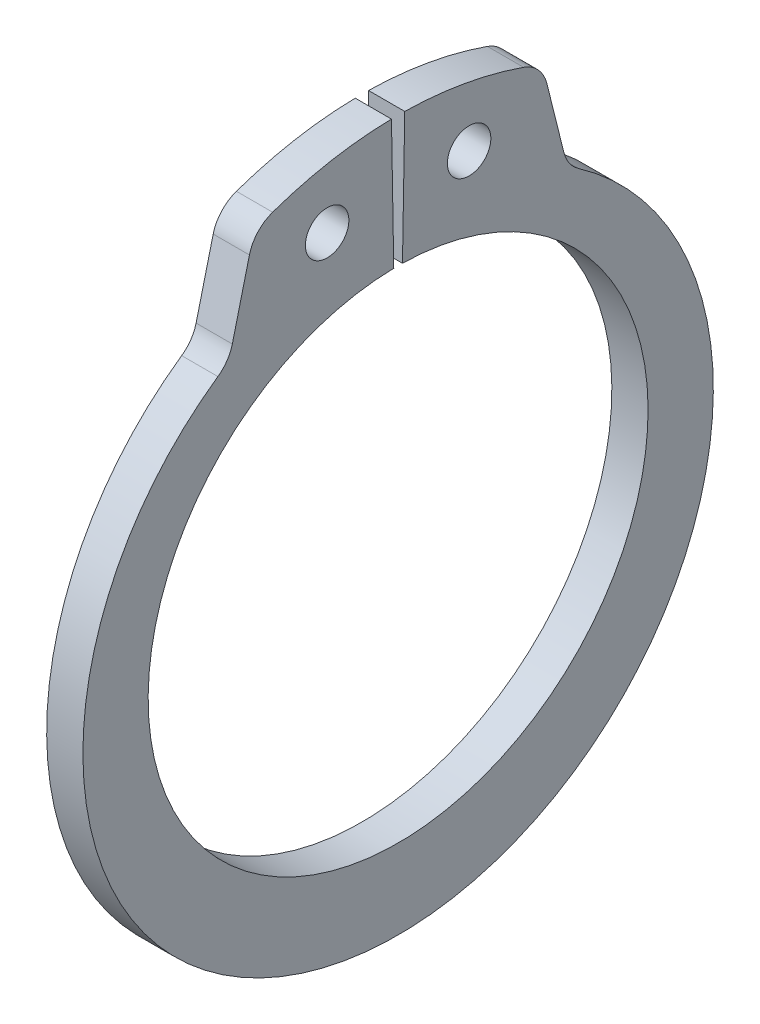
ISO-10303-21;
HEADER;
FILE_DESCRIPTION(('STEP AP214'),'2;1');
FILE_NAME('part.step','',(''),(''),'','','');
FILE_SCHEMA(('AUTOMOTIVE_DESIGN { 1 0 10303 214 1 1 1 1 }'));
ENDSEC;
DATA;
#1=APPLICATION_CONTEXT('core data for automotive mechanical design processes');
#2=APPLICATION_PROTOCOL_DEFINITION('international standard','automotive_design',2000,#1);
#3=PRODUCT_CONTEXT('',#1,'mechanical');
#4=PRODUCT('Part','Part','',(#3));
#5=PRODUCT_RELATED_PRODUCT_CATEGORY('part','',(#4));
#6=PRODUCT_DEFINITION_FORMATION('','',#4);
#7=PRODUCT_DEFINITION_CONTEXT('part definition',#1,'design');
#8=PRODUCT_DEFINITION('design','',#6,#7);
#9=PRODUCT_DEFINITION_SHAPE('','',#8);
#10=(LENGTH_UNIT() NAMED_UNIT(*) SI_UNIT(.MILLI.,.METRE.));
#11=(NAMED_UNIT(*) PLANE_ANGLE_UNIT() SI_UNIT($,.RADIAN.));
#12=(NAMED_UNIT(*) SI_UNIT($,.STERADIAN.) SOLID_ANGLE_UNIT());
#13=UNCERTAINTY_MEASURE_WITH_UNIT(LENGTH_MEASURE(1.E-05),#10,'distance_accuracy_value','');
#14=(GEOMETRIC_REPRESENTATION_CONTEXT(3) GLOBAL_UNCERTAINTY_ASSIGNED_CONTEXT((#13)) GLOBAL_UNIT_ASSIGNED_CONTEXT((#10,
#11,#12)) REPRESENTATION_CONTEXT('',''));
#15=CARTESIAN_POINT('',(0.,0.,0.));
#16=DIRECTION('',(0.,0.,1.));
#17=DIRECTION('',(1.,0.,0.));
#18=AXIS2_PLACEMENT_3D('',#15,#16,#17);
#19=CARTESIAN_POINT('',(0.5,0.,0.));
#20=DIRECTION('',(1.,0.,0.));
#21=DIRECTION('',(0.,0.,-1.));
#22=AXIS2_PLACEMENT_3D('',#19,#20,#21);
#23=PLANE('',#22);
#24=CARTESIAN_POINT('',(0.5,8.66711980549086,-1.9596288316201));
#25=DIRECTION('',(-1.,0.,0.));
#26=DIRECTION('',(0.,0.,1.));
#27=AXIS2_PLACEMENT_3D('',#24,#25,#26);
#28=CIRCLE('',#27,0.6);
#29=CARTESIAN_POINT('',(0.5,8.66711980549086,-1.3596288316201));
#30=VERTEX_POINT('',#29);
#31=EDGE_CURVE('E114',#30,#30,#28,.T.);
#32=ORIENTED_EDGE('',*,*,#31,.T.);
#33=EDGE_LOOP('',(#32));
#34=FACE_BOUND('',#33,.T.);
#35=CARTESIAN_POINT('',(0.5,0.,0.));
#36=DIRECTION('',(-1.,0.,0.));
#37=DIRECTION('',(0.,0.,1.));
#38=AXIS2_PLACEMENT_3D('',#35,#36,#37);
#39=CIRCLE('',#38,6.9);
#40=CARTESIAN_POINT('',(0.5,6.8989490965791,-0.120421604417256));
#41=VERTEX_POINT('',#40);
#42=CARTESIAN_POINT('',(0.5,6.8989490965791,0.120421604417256));
#43=VERTEX_POINT('',#42);
#44=EDGE_CURVE('E172',#41,#43,#39,.T.);
#45=ORIENTED_EDGE('',*,*,#44,.T.);
#46=DIRECTION('',(0.,-0.999847695156391,-0.0174524064372835));
#47=VECTOR('',#46,1.);
#48=CARTESIAN_POINT('',(0.5,6.8989490965791,0.120421604417256));
#49=LINE('',#48,#47);
#50=CARTESIAN_POINT('',(0.5,10.4984007991421,0.183250267591477));
#51=VERTEX_POINT('',#50);
#52=EDGE_CURVE('E125',#43,#51,#49,.F.);
#53=ORIENTED_EDGE('',*,*,#52,.T.);
#54=CARTESIAN_POINT('',(0.5,0.,0.));
#55=DIRECTION('',(-1.,0.,0.));
#56=DIRECTION('',(0.,0.,1.));
#57=AXIS2_PLACEMENT_3D('',#54,#55,#56);
#58=CIRCLE('',#57,10.5);
#59=CARTESIAN_POINT('',(0.5,9.91217887924345,3.46391539531209));
#60=VERTEX_POINT('',#59);
#61=EDGE_CURVE('E128',#60,#51,#58,.T.);
#62=ORIENTED_EDGE('',*,*,#61,.F.);
#63=CARTESIAN_POINT('',(0.5,8.96816184312502,3.13401869099666));
#64=DIRECTION('',(-1.,0.,0.));
#65=DIRECTION('',(0.,0.,1.));
#66=AXIS2_PLACEMENT_3D('',#63,#64,#65);
#67=CIRCLE('',#66,1.);
#68=CARTESIAN_POINT('',(0.5,9.21008373872469,4.10431441727265));
#69=VERTEX_POINT('',#68);
#70=EDGE_CURVE('E118',#69,#60,#67,.T.);
#71=ORIENTED_EDGE('',*,*,#70,.F.);
#72=DIRECTION('',(0.,0.970295726275997,-0.241921895599665));
#73=VECTOR('',#72,1.);
#74=CARTESIAN_POINT('',(0.5,9.71734472745919,3.97784004803122));
#75=LINE('',#74,#73);
#76=CARTESIAN_POINT('',(0.5,7.31761530924591,4.57615979123836));
#77=VERTEX_POINT('',#76);
#78=EDGE_CURVE('E113',#69,#77,#75,.F.);
#79=ORIENTED_EDGE('',*,*,#78,.T.);
#80=CARTESIAN_POINT('',(0.5,7.55953720484558,5.54645551751436));
#81=DIRECTION('',(-1.,0.,0.));
#82=DIRECTION('',(0.,0.,1.));
#83=AXIS2_PLACEMENT_3D('',#80,#81,#82);
#84=CIRCLE('',#83,1.);
#85=CARTESIAN_POINT('',(0.5,6.73911195964233,4.97470170945253));
#86=VERTEX_POINT('',#85);
#87=EDGE_CURVE('E104',#77,#86,#84,.T.);
#88=ORIENTED_EDGE('',*,*,#87,.T.);
#89=CARTESIAN_POINT('',(0.5,-0.399224177769538,0.));
#90=DIRECTION('',(-1.,0.,0.));
#91=DIRECTION('',(0.,0.,1.));
#92=AXIS2_PLACEMENT_3D('',#89,#90,#91);
#93=CIRCLE('',#92,8.70077582223046);
#94=CARTESIAN_POINT('',(0.5,6.73911195964233,-4.97470170945253));
#95=VERTEX_POINT('',#94);
#96=EDGE_CURVE('E182',#95,#86,#93,.T.);
#97=ORIENTED_EDGE('',*,*,#96,.F.);
#98=CARTESIAN_POINT('',(0.5,7.55953720484558,-5.54645551751436));
#99=DIRECTION('',(-1.,0.,0.));
#100=DIRECTION('',(0.,0.,1.));
#101=AXIS2_PLACEMENT_3D('',#98,#99,#100);
#102=CIRCLE('',#101,1.);
#103=CARTESIAN_POINT('',(0.5,7.31761530924591,-4.57615979123836));
#104=VERTEX_POINT('',#103);
#105=EDGE_CURVE('E179',#95,#104,#102,.T.);
#106=ORIENTED_EDGE('',*,*,#105,.T.);
#107=DIRECTION('',(0.,-0.970295726275997,-0.241921895599666));
#108=VECTOR('',#107,1.);
#109=CARTESIAN_POINT('',(0.5,9.71734472745919,-3.97784004803122));
#110=LINE('',#109,#108);
#111=CARTESIAN_POINT('',(0.5,9.21008373872469,-4.10431441727265));
#112=VERTEX_POINT('',#111);
#113=EDGE_CURVE('E135',#104,#112,#110,.F.);
#114=ORIENTED_EDGE('',*,*,#113,.T.);
#115=CARTESIAN_POINT('',(0.5,8.96816184312502,-3.13401869099666));
#116=DIRECTION('',(-1.,0.,0.));
#117=DIRECTION('',(0.,0.,1.));
#118=AXIS2_PLACEMENT_3D('',#115,#116,#117);
#119=CIRCLE('',#118,1.);
#120=CARTESIAN_POINT('',(0.5,9.91217887924345,-3.46391539531209));
#121=VERTEX_POINT('',#120);
#122=EDGE_CURVE('E137',#121,#112,#119,.T.);
#123=ORIENTED_EDGE('',*,*,#122,.F.);
#124=CARTESIAN_POINT('',(0.5,0.,0.));
#125=DIRECTION('',(-1.,0.,0.));
#126=DIRECTION('',(0.,0.,1.));
#127=AXIS2_PLACEMENT_3D('',#124,#125,#126);
#128=CIRCLE('',#127,10.5);
#129=CARTESIAN_POINT('',(0.5,10.4984007991421,-0.183250267591479));
#130=VERTEX_POINT('',#129);
#131=EDGE_CURVE('E174',#130,#121,#128,.T.);
#132=ORIENTED_EDGE('',*,*,#131,.F.);
#133=DIRECTION('',(0.,0.999847695156391,-0.0174524064372841));
#134=VECTOR('',#133,1.);
#135=CARTESIAN_POINT('',(0.5,10.4984007991421,-0.183250267591479));
#136=LINE('',#135,#134);
#137=EDGE_CURVE('E130',#130,#41,#136,.F.);
#138=ORIENTED_EDGE('',*,*,#137,.T.);
#139=EDGE_LOOP('',(#45,#53,#62,#71,#79,#88,#97,#106,#114,#123,#132,#138));
#140=FACE_BOUND('',#139,.T.);
#141=CARTESIAN_POINT('',(0.5,8.66711980549086,1.9596288316201));
#142=DIRECTION('',(-1.,0.,0.));
#143=DIRECTION('',(0.,0.,1.));
#144=AXIS2_PLACEMENT_3D('',#141,#142,#143);
#145=CIRCLE('',#144,0.6);
#146=CARTESIAN_POINT('',(0.5,8.66711980549086,2.5596288316201));
#147=VERTEX_POINT('',#146);
#148=EDGE_CURVE('E19',#147,#147,#145,.T.);
#149=ORIENTED_EDGE('',*,*,#148,.T.);
#150=EDGE_LOOP('',(#149));
#151=FACE_BOUND('',#150,.T.);
#152=ADVANCED_FACE('F16',(#34,#140,#151),#23,.T.);
#153=CARTESIAN_POINT('',(0.5,8.66711980549086,1.9596288316201));
#154=DIRECTION('',(-1.,0.,0.));
#155=DIRECTION('',(0.,0.,1.));
#156=AXIS2_PLACEMENT_3D('',#153,#154,#155);
#157=CYLINDRICAL_SURFACE('',#156,0.6);
#158=CARTESIAN_POINT('',(-0.5,8.66711980549086,1.9596288316201));
#159=DIRECTION('',(-1.,0.,0.));
#160=DIRECTION('',(0.,0.,1.));
#161=AXIS2_PLACEMENT_3D('',#158,#159,#160);
#162=CIRCLE('',#161,0.6);
#163=CARTESIAN_POINT('',(-0.5,8.66711980549086,2.5596288316201));
#164=VERTEX_POINT('',#163);
#165=EDGE_CURVE('E164',#164,#164,#162,.T.);
#166=ORIENTED_EDGE('',*,*,#165,.T.);
#167=EDGE_LOOP('',(#166));
#168=FACE_BOUND('',#167,.T.);
#169=ORIENTED_EDGE('',*,*,#148,.F.);
#170=EDGE_LOOP('',(#169));
#171=FACE_BOUND('',#170,.T.);
#172=ADVANCED_FACE('F367',(#168,#171),#157,.F.);
#173=CARTESIAN_POINT('',(0.5,7.55953720484558,5.54645551751436));
#174=DIRECTION('',(-1.,0.,0.));
#175=DIRECTION('',(0.,0.,1.));
#176=AXIS2_PLACEMENT_3D('',#173,#174,#175);
#177=CYLINDRICAL_SURFACE('',#176,1.);
#178=DIRECTION('',(1.,0.,0.));
#179=VECTOR('',#178,1.);
#180=CARTESIAN_POINT('',(0.5,7.31761530924591,4.57615979123836));
#181=LINE('',#180,#179);
#182=CARTESIAN_POINT('',(-0.5,7.31761530924591,4.57615979123836));
#183=VERTEX_POINT('',#182);
#184=EDGE_CURVE('E108',#77,#183,#181,.F.);
#185=ORIENTED_EDGE('',*,*,#184,.T.);
#186=CARTESIAN_POINT('',(-0.5,7.55953720484558,5.54645551751436));
#187=DIRECTION('',(-1.,0.,0.));
#188=DIRECTION('',(0.,0.,1.));
#189=AXIS2_PLACEMENT_3D('',#186,#187,#188);
#190=CIRCLE('',#189,1.);
#191=CARTESIAN_POINT('',(-0.5,6.73911195964233,4.97470170945253));
#192=VERTEX_POINT('',#191);
#193=EDGE_CURVE('E162',#183,#192,#190,.T.);
#194=ORIENTED_EDGE('',*,*,#193,.T.);
#195=DIRECTION('',(-1.,0.,0.));
#196=VECTOR('',#195,1.);
#197=CARTESIAN_POINT('',(0.5,6.73911195964233,4.97470170945253));
#198=LINE('',#197,#196);
#199=EDGE_CURVE('E109',#86,#192,#198,.T.);
#200=ORIENTED_EDGE('',*,*,#199,.F.);
#201=ORIENTED_EDGE('',*,*,#87,.F.);
#202=EDGE_LOOP('',(#185,#194,#200,#201));
#203=FACE_BOUND('',#202,.T.);
#204=ADVANCED_FACE('F106',(#203),#177,.F.);
#205=CARTESIAN_POINT('',(0.5,-0.399224177769538,0.));
#206=DIRECTION('',(-1.,0.,0.));
#207=DIRECTION('',(0.,0.,1.));
#208=AXIS2_PLACEMENT_3D('',#205,#206,#207);
#209=CYLINDRICAL_SURFACE('',#208,8.70077582223046);
#210=CARTESIAN_POINT('',(-0.5,-0.399224177769538,0.));
#211=DIRECTION('',(-1.,0.,0.));
#212=DIRECTION('',(0.,0.,1.));
#213=AXIS2_PLACEMENT_3D('',#210,#211,#212);
#214=CIRCLE('',#213,8.70077582223046);
#215=CARTESIAN_POINT('',(-0.5,6.73911195964233,-4.97470170945253));
#216=VERTEX_POINT('',#215);
#217=EDGE_CURVE('E160',#192,#216,#214,.F.);
#218=ORIENTED_EDGE('',*,*,#217,.T.);
#219=DIRECTION('',(-1.,0.,0.));
#220=VECTOR('',#219,1.);
#221=CARTESIAN_POINT('',(0.5,6.73911195964233,-4.97470170945253));
#222=LINE('',#221,#220);
#223=EDGE_CURVE('E181',#216,#95,#222,.F.);
#224=ORIENTED_EDGE('',*,*,#223,.T.);
#225=ORIENTED_EDGE('',*,*,#96,.T.);
#226=ORIENTED_EDGE('',*,*,#199,.T.);
#227=EDGE_LOOP('',(#218,#224,#225,#226));
#228=FACE_BOUND('',#227,.T.);
#229=ADVANCED_FACE('F187',(#228),#209,.T.);
#230=CARTESIAN_POINT('',(0.5,7.55953720484558,-5.54645551751436));
#231=DIRECTION('',(-1.,0.,0.));
#232=DIRECTION('',(0.,0.,1.));
#233=AXIS2_PLACEMENT_3D('',#230,#231,#232);
#234=CYLINDRICAL_SURFACE('',#233,1.);
#235=ORIENTED_EDGE('',*,*,#223,.F.);
#236=CARTESIAN_POINT('',(-0.5,7.55953720484558,-5.54645551751436));
#237=DIRECTION('',(-1.,0.,0.));
#238=DIRECTION('',(0.,0.,1.));
#239=AXIS2_PLACEMENT_3D('',#236,#237,#238);
#240=CIRCLE('',#239,1.);
#241=CARTESIAN_POINT('',(-0.5,7.31761530924591,-4.57615979123836));
#242=VERTEX_POINT('',#241);
#243=EDGE_CURVE('E157',#216,#242,#240,.T.);
#244=ORIENTED_EDGE('',*,*,#243,.T.);
#245=DIRECTION('',(1.,0.,0.));
#246=VECTOR('',#245,1.);
#247=CARTESIAN_POINT('',(0.5,7.31761530924591,-4.57615979123836));
#248=LINE('',#247,#246);
#249=EDGE_CURVE('E138',#242,#104,#248,.T.);
#250=ORIENTED_EDGE('',*,*,#249,.T.);
#251=ORIENTED_EDGE('',*,*,#105,.F.);
#252=EDGE_LOOP('',(#235,#244,#250,#251));
#253=FACE_BOUND('',#252,.T.);
#254=ADVANCED_FACE('F199',(#253),#234,.F.);
#255=CARTESIAN_POINT('',(0.5,9.71734472745919,-3.97784004803122));
#256=DIRECTION('',(0.,-0.241921895599666,0.970295726275997));
#257=DIRECTION('',(0.,-0.970295726275997,-0.241921895599666));
#258=AXIS2_PLACEMENT_3D('',#255,#256,#257);
#259=PLANE('',#258);
#260=DIRECTION('',(-1.,0.,0.));
#261=VECTOR('',#260,1.);
#262=CARTESIAN_POINT('',(0.5,9.21008373872469,-4.10431441727265));
#263=LINE('',#262,#261);
#264=CARTESIAN_POINT('',(-0.5,9.21008373872469,-4.10431441727265));
#265=VERTEX_POINT('',#264);
#266=EDGE_CURVE('E177',#112,#265,#263,.T.);
#267=ORIENTED_EDGE('',*,*,#266,.F.);
#268=ORIENTED_EDGE('',*,*,#113,.F.);
#269=ORIENTED_EDGE('',*,*,#249,.F.);
#270=DIRECTION('',(0.,0.970295726275997,0.241921895599666));
#271=VECTOR('',#270,1.);
#272=CARTESIAN_POINT('',(-0.5,7.31761530924591,-4.57615979123836));
#273=LINE('',#272,#271);
#274=EDGE_CURVE('E156',#242,#265,#273,.T.);
#275=ORIENTED_EDGE('',*,*,#274,.T.);
#276=EDGE_LOOP('',(#267,#268,#269,#275));
#277=FACE_BOUND('',#276,.T.);
#278=ADVANCED_FACE('F205',(#277),#259,.F.);
#279=CARTESIAN_POINT('',(0.5,8.96816184312502,-3.13401869099666));
#280=DIRECTION('',(-1.,0.,0.));
#281=DIRECTION('',(0.,0.,1.));
#282=AXIS2_PLACEMENT_3D('',#279,#280,#281);
#283=CYLINDRICAL_SURFACE('',#282,1.);
#284=CARTESIAN_POINT('',(-0.5,8.96816184312502,-3.13401869099666));
#285=DIRECTION('',(-1.,0.,0.));
#286=DIRECTION('',(0.,0.,1.));
#287=AXIS2_PLACEMENT_3D('',#284,#285,#286);
#288=CIRCLE('',#287,1.);
#289=CARTESIAN_POINT('',(-0.5,9.91217887924345,-3.46391539531209));
#290=VERTEX_POINT('',#289);
#291=EDGE_CURVE('E153',#265,#290,#288,.F.);
#292=ORIENTED_EDGE('',*,*,#291,.T.);
#293=DIRECTION('',(-1.,0.,0.));
#294=VECTOR('',#293,1.);
#295=CARTESIAN_POINT('',(0.5,9.91217887924345,-3.46391539531209));
#296=LINE('',#295,#294);
#297=EDGE_CURVE('E176',#121,#290,#296,.T.);
#298=ORIENTED_EDGE('',*,*,#297,.F.);
#299=ORIENTED_EDGE('',*,*,#122,.T.);
#300=ORIENTED_EDGE('',*,*,#266,.T.);
#301=EDGE_LOOP('',(#292,#298,#299,#300));
#302=FACE_BOUND('',#301,.T.);
#303=ADVANCED_FACE('F245',(#302),#283,.T.);
#304=CARTESIAN_POINT('',(0.5,0.,0.));
#305=DIRECTION('',(-1.,0.,0.));
#306=DIRECTION('',(0.,0.,1.));
#307=AXIS2_PLACEMENT_3D('',#304,#305,#306);
#308=CYLINDRICAL_SURFACE('',#307,10.5);
#309=CARTESIAN_POINT('',(-0.5,0.,0.));
#310=DIRECTION('',(-1.,0.,0.));
#311=DIRECTION('',(0.,0.,1.));
#312=AXIS2_PLACEMENT_3D('',#309,#310,#311);
#313=CIRCLE('',#312,10.5);
#314=CARTESIAN_POINT('',(-0.5,10.4984007991421,-0.183250267591479));
#315=VERTEX_POINT('',#314);
#316=EDGE_CURVE('E150',#290,#315,#313,.F.);
#317=ORIENTED_EDGE('',*,*,#316,.T.);
#318=DIRECTION('',(1.,0.,0.));
#319=VECTOR('',#318,1.);
#320=CARTESIAN_POINT('',(0.5,10.4984007991421,-0.183250267591479));
#321=LINE('',#320,#319);
#322=EDGE_CURVE('E134',#315,#130,#321,.T.);
#323=ORIENTED_EDGE('',*,*,#322,.T.);
#324=ORIENTED_EDGE('',*,*,#131,.T.);
#325=ORIENTED_EDGE('',*,*,#297,.T.);
#326=EDGE_LOOP('',(#317,#323,#324,#325));
#327=FACE_BOUND('',#326,.T.);
#328=ADVANCED_FACE('F243',(#327),#308,.T.);
#329=CARTESIAN_POINT('',(0.5,10.4984007991421,-0.183250267591479));
#330=DIRECTION('',(0.,-0.0174524064372841,-0.999847695156391));
#331=DIRECTION('',(0.,0.999847695156391,-0.0174524064372841));
#332=AXIS2_PLACEMENT_3D('',#329,#330,#331);
#333=PLANE('',#332);
#334=DIRECTION('',(-1.,0.,0.));
#335=VECTOR('',#334,1.);
#336=CARTESIAN_POINT('',(0.5,6.8989490965791,-0.120421604417256));
#337=LINE('',#336,#335);
#338=CARTESIAN_POINT('',(-0.5,6.8989490965791,-0.120421604417256));
#339=VERTEX_POINT('',#338);
#340=EDGE_CURVE('E133',#339,#41,#337,.F.);
#341=ORIENTED_EDGE('',*,*,#340,.T.);
#342=ORIENTED_EDGE('',*,*,#137,.F.);
#343=ORIENTED_EDGE('',*,*,#322,.F.);
#344=DIRECTION('',(0.,-0.999847695156391,0.017452406437284));
#345=VECTOR('',#344,1.);
#346=CARTESIAN_POINT('',(-0.5,10.4984007991421,-0.183250267591479));
#347=LINE('',#346,#345);
#348=EDGE_CURVE('E149',#315,#339,#347,.T.);
#349=ORIENTED_EDGE('',*,*,#348,.T.);
#350=EDGE_LOOP('',(#341,#342,#343,#349));
#351=FACE_BOUND('',#350,.T.);
#352=ADVANCED_FACE('F240',(#351),#333,.F.);
#353=CARTESIAN_POINT('',(0.5,0.,0.));
#354=DIRECTION('',(-1.,0.,0.));
#355=DIRECTION('',(0.,0.,1.));
#356=AXIS2_PLACEMENT_3D('',#353,#354,#355);
#357=CYLINDRICAL_SURFACE('',#356,6.9);
#358=ORIENTED_EDGE('',*,*,#44,.F.);
#359=ORIENTED_EDGE('',*,*,#340,.F.);
#360=CARTESIAN_POINT('',(-0.5,0.,0.));
#361=DIRECTION('',(-1.,0.,0.));
#362=DIRECTION('',(0.,0.,1.));
#363=AXIS2_PLACEMENT_3D('',#360,#361,#362);
#364=CIRCLE('',#363,6.9);
#365=CARTESIAN_POINT('',(-0.5,6.8989490965791,0.120421604417256));
#366=VERTEX_POINT('',#365);
#367=EDGE_CURVE('E147',#339,#366,#364,.T.);
#368=ORIENTED_EDGE('',*,*,#367,.T.);
#369=DIRECTION('',(1.,0.,0.));
#370=VECTOR('',#369,1.);
#371=CARTESIAN_POINT('',(0.5,6.8989490965791,0.120421604417256));
#372=LINE('',#371,#370);
#373=EDGE_CURVE('E129',#366,#43,#372,.T.);
#374=ORIENTED_EDGE('',*,*,#373,.T.);
#375=EDGE_LOOP('',(#358,#359,#368,#374));
#376=FACE_BOUND('',#375,.T.);
#377=ADVANCED_FACE('F237',(#376),#357,.F.);
#378=CARTESIAN_POINT('',(0.5,6.8989490965791,0.120421604417256));
#379=DIRECTION('',(0.,-0.0174524064372835,0.999847695156391));
#380=DIRECTION('',(0.,-0.999847695156391,-0.0174524064372835));
#381=AXIS2_PLACEMENT_3D('',#378,#379,#380);
#382=PLANE('',#381);
#383=DIRECTION('',(-1.,0.,0.));
#384=VECTOR('',#383,1.);
#385=CARTESIAN_POINT('',(0.5,10.4984007991421,0.183250267591476));
#386=LINE('',#385,#384);
#387=CARTESIAN_POINT('',(-0.5,10.4984007991421,0.183250267591477));
#388=VERTEX_POINT('',#387);
#389=EDGE_CURVE('E170',#51,#388,#386,.T.);
#390=ORIENTED_EDGE('',*,*,#389,.F.);
#391=ORIENTED_EDGE('',*,*,#52,.F.);
#392=ORIENTED_EDGE('',*,*,#373,.F.);
#393=DIRECTION('',(0.,0.999847695156391,0.0174524064372835));
#394=VECTOR('',#393,1.);
#395=CARTESIAN_POINT('',(-0.5,6.8989490965791,0.120421604417256));
#396=LINE('',#395,#394);
#397=EDGE_CURVE('E146',#366,#388,#396,.T.);
#398=ORIENTED_EDGE('',*,*,#397,.T.);
#399=EDGE_LOOP('',(#390,#391,#392,#398));
#400=FACE_BOUND('',#399,.T.);
#401=ADVANCED_FACE('F228',(#400),#382,.F.);
#402=CARTESIAN_POINT('',(0.5,0.,0.));
#403=DIRECTION('',(-1.,0.,0.));
#404=DIRECTION('',(0.,0.,1.));
#405=AXIS2_PLACEMENT_3D('',#402,#403,#404);
#406=CYLINDRICAL_SURFACE('',#405,10.5);
#407=ORIENTED_EDGE('',*,*,#61,.T.);
#408=ORIENTED_EDGE('',*,*,#389,.T.);
#409=CARTESIAN_POINT('',(-0.5,0.,0.));
#410=DIRECTION('',(-1.,0.,0.));
#411=DIRECTION('',(0.,0.,1.));
#412=AXIS2_PLACEMENT_3D('',#409,#410,#411);
#413=CIRCLE('',#412,10.5);
#414=CARTESIAN_POINT('',(-0.5,9.91217887924345,3.46391539531209));
#415=VERTEX_POINT('',#414);
#416=EDGE_CURVE('E143',#388,#415,#413,.F.);
#417=ORIENTED_EDGE('',*,*,#416,.T.);
#418=DIRECTION('',(-1.,0.,0.));
#419=VECTOR('',#418,1.);
#420=CARTESIAN_POINT('',(0.5,9.91217887924345,3.46391539531209));
#421=LINE('',#420,#419);
#422=EDGE_CURVE('E120',#60,#415,#421,.T.);
#423=ORIENTED_EDGE('',*,*,#422,.F.);
#424=EDGE_LOOP('',(#407,#408,#417,#423));
#425=FACE_BOUND('',#424,.T.);
#426=ADVANCED_FACE('F235',(#425),#406,.T.);
#427=CARTESIAN_POINT('',(0.5,8.96816184312502,3.13401869099666));
#428=DIRECTION('',(-1.,0.,0.));
#429=DIRECTION('',(0.,0.,1.));
#430=AXIS2_PLACEMENT_3D('',#427,#428,#429);
#431=CYLINDRICAL_SURFACE('',#430,1.);
#432=CARTESIAN_POINT('',(-0.5,8.96816184312502,3.13401869099666));
#433=DIRECTION('',(-1.,0.,0.));
#434=DIRECTION('',(0.,0.,1.));
#435=AXIS2_PLACEMENT_3D('',#432,#433,#434);
#436=CIRCLE('',#435,1.);
#437=CARTESIAN_POINT('',(-0.5,9.21008373872469,4.10431441727265));
#438=VERTEX_POINT('',#437);
#439=EDGE_CURVE('E140',#415,#438,#436,.F.);
#440=ORIENTED_EDGE('',*,*,#439,.T.);
#441=DIRECTION('',(1.,0.,0.));
#442=VECTOR('',#441,1.);
#443=CARTESIAN_POINT('',(0.5,9.21008373872469,4.10431441727265));
#444=LINE('',#443,#442);
#445=EDGE_CURVE('E34',#438,#69,#444,.T.);
#446=ORIENTED_EDGE('',*,*,#445,.T.);
#447=ORIENTED_EDGE('',*,*,#70,.T.);
#448=ORIENTED_EDGE('',*,*,#422,.T.);
#449=EDGE_LOOP('',(#440,#446,#447,#448));
#450=FACE_BOUND('',#449,.T.);
#451=ADVANCED_FACE('F268',(#450),#431,.T.);
#452=CARTESIAN_POINT('',(0.5,9.71734472745919,3.97784004803122));
#453=DIRECTION('',(0.,-0.241921895599665,-0.970295726275997));
#454=DIRECTION('',(0.,0.970295726275997,-0.241921895599665));
#455=AXIS2_PLACEMENT_3D('',#452,#453,#454);
#456=PLANE('',#455);
#457=ORIENTED_EDGE('',*,*,#184,.F.);
#458=ORIENTED_EDGE('',*,*,#78,.F.);
#459=ORIENTED_EDGE('',*,*,#445,.F.);
#460=DIRECTION('',(0.,-0.970295726275997,0.241921895599665));
#461=VECTOR('',#460,1.);
#462=CARTESIAN_POINT('',(-0.5,9.21008373872469,4.10431441727265));
#463=LINE('',#462,#461);
#464=EDGE_CURVE('E25',#438,#183,#463,.T.);
#465=ORIENTED_EDGE('',*,*,#464,.T.);
#466=EDGE_LOOP('',(#457,#458,#459,#465));
#467=FACE_BOUND('',#466,.T.);
#468=ADVANCED_FACE('F112',(#467),#456,.F.);
#469=CARTESIAN_POINT('',(0.5,8.66711980549086,-1.9596288316201));
#470=DIRECTION('',(-1.,0.,0.));
#471=DIRECTION('',(0.,0.,1.));
#472=AXIS2_PLACEMENT_3D('',#469,#470,#471);
#473=CYLINDRICAL_SURFACE('',#472,0.6);
#474=CARTESIAN_POINT('',(-0.5,8.66711980549086,-1.9596288316201));
#475=DIRECTION('',(-1.,0.,0.));
#476=DIRECTION('',(0.,0.,1.));
#477=AXIS2_PLACEMENT_3D('',#474,#475,#476);
#478=CIRCLE('',#477,0.6);
#479=CARTESIAN_POINT('',(-0.5,8.66711980549086,-1.3596288316201));
#480=VERTEX_POINT('',#479);
#481=EDGE_CURVE('E11',#480,#480,#478,.T.);
#482=ORIENTED_EDGE('',*,*,#481,.T.);
#483=EDGE_LOOP('',(#482));
#484=FACE_BOUND('',#483,.T.);
#485=ORIENTED_EDGE('',*,*,#31,.F.);
#486=EDGE_LOOP('',(#485));
#487=FACE_BOUND('',#486,.T.);
#488=ADVANCED_FACE('F256',(#484,#487),#473,.F.);
#489=CARTESIAN_POINT('',(-0.5,0.,0.));
#490=DIRECTION('',(1.,0.,0.));
#491=DIRECTION('',(0.,0.,-1.));
#492=AXIS2_PLACEMENT_3D('',#489,#490,#491);
#493=PLANE('',#492);
#494=ORIENTED_EDGE('',*,*,#481,.F.);
#495=EDGE_LOOP('',(#494));
#496=FACE_BOUND('',#495,.T.);
#497=ORIENTED_EDGE('',*,*,#439,.F.);
#498=ORIENTED_EDGE('',*,*,#416,.F.);
#499=ORIENTED_EDGE('',*,*,#397,.F.);
#500=ORIENTED_EDGE('',*,*,#367,.F.);
#501=ORIENTED_EDGE('',*,*,#348,.F.);
#502=ORIENTED_EDGE('',*,*,#316,.F.);
#503=ORIENTED_EDGE('',*,*,#291,.F.);
#504=ORIENTED_EDGE('',*,*,#274,.F.);
#505=ORIENTED_EDGE('',*,*,#243,.F.);
#506=ORIENTED_EDGE('',*,*,#217,.F.);
#507=ORIENTED_EDGE('',*,*,#193,.F.);
#508=ORIENTED_EDGE('',*,*,#464,.F.);
#509=EDGE_LOOP('',(#497,#498,#499,#500,#501,#502,#503,#504,#505,#506,#507,#508));
#510=FACE_BOUND('',#509,.T.);
#511=ORIENTED_EDGE('',*,*,#165,.F.);
#512=EDGE_LOOP('',(#511));
#513=FACE_BOUND('',#512,.T.);
#514=ADVANCED_FACE('F192',(#496,#510,#513),#493,.F.);
#515=CLOSED_SHELL('',(#152,#172,#204,#229,#254,#278,#303,#328,#352,#377,#401,#426,#451,#468,
#488,#514));
#516=MANIFOLD_SOLID_BREP('B1',#515);
#517=ADVANCED_BREP_SHAPE_REPRESENTATION('',(#18,#516),#14);
#518=SHAPE_DEFINITION_REPRESENTATION(#9,#517);
ENDSEC;
END-ISO-10303-21;
